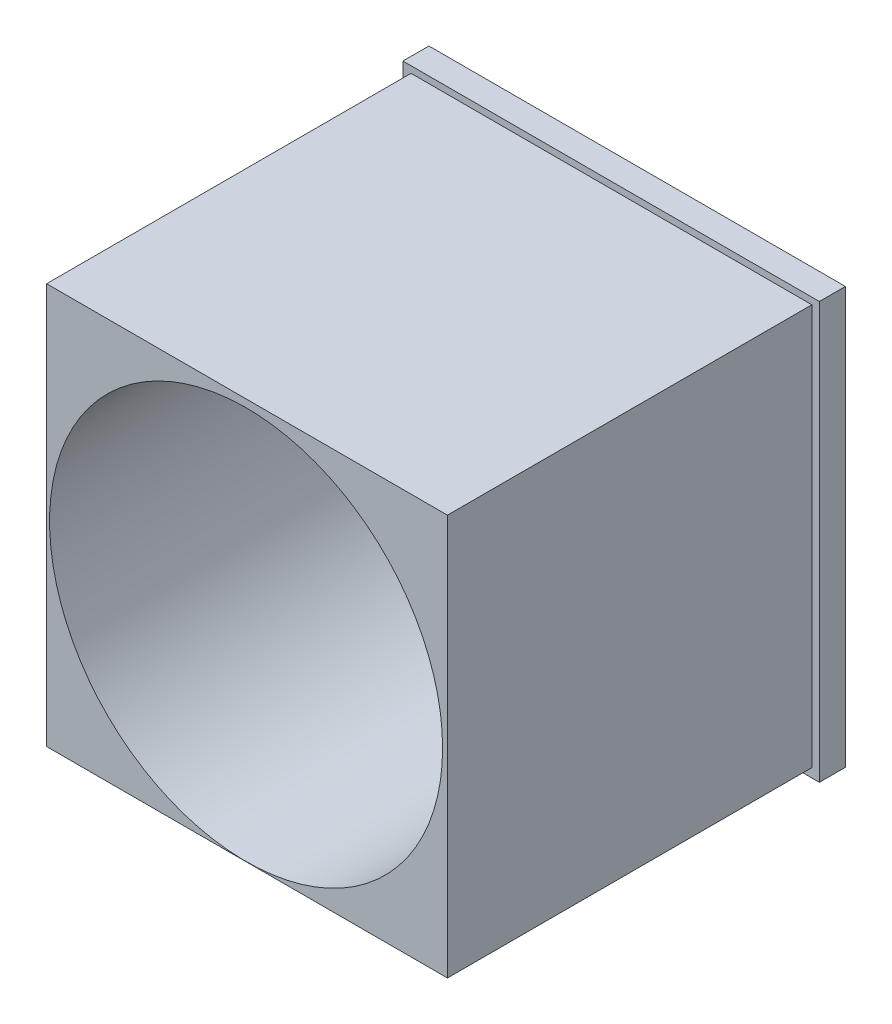
ISO-10303-21;
HEADER;
FILE_DESCRIPTION(('STEP AP214'),'2;1');
FILE_NAME('part.step','',(''),(''),'','','');
FILE_SCHEMA(('AUTOMOTIVE_DESIGN { 1 0 10303 214 1 1 1 1 }'));
ENDSEC;
DATA;
#1=APPLICATION_CONTEXT('core data for automotive mechanical design processes');
#2=APPLICATION_PROTOCOL_DEFINITION('international standard','automotive_design',2000,#1);
#3=PRODUCT_CONTEXT('',#1,'mechanical');
#4=PRODUCT('Part','Part','',(#3));
#5=PRODUCT_RELATED_PRODUCT_CATEGORY('part','',(#4));
#6=PRODUCT_DEFINITION_FORMATION('','',#4);
#7=PRODUCT_DEFINITION_CONTEXT('part definition',#1,'design');
#8=PRODUCT_DEFINITION('design','',#6,#7);
#9=PRODUCT_DEFINITION_SHAPE('','',#8);
#10=(LENGTH_UNIT() NAMED_UNIT(*) SI_UNIT(.MILLI.,.METRE.));
#11=(NAMED_UNIT(*) PLANE_ANGLE_UNIT() SI_UNIT($,.RADIAN.));
#12=(NAMED_UNIT(*) SI_UNIT($,.STERADIAN.) SOLID_ANGLE_UNIT());
#13=UNCERTAINTY_MEASURE_WITH_UNIT(LENGTH_MEASURE(1.E-05),#10,'distance_accuracy_value','');
#14=(GEOMETRIC_REPRESENTATION_CONTEXT(3) GLOBAL_UNCERTAINTY_ASSIGNED_CONTEXT((#13)) GLOBAL_UNIT_ASSIGNED_CONTEXT((#10,
#11,#12)) REPRESENTATION_CONTEXT('',''));
#15=CARTESIAN_POINT('',(0.,0.,0.));
#16=DIRECTION('',(0.,0.,1.));
#17=DIRECTION('',(1.,0.,0.));
#18=AXIS2_PLACEMENT_3D('',#15,#16,#17);
#19=CARTESIAN_POINT('',(-19.8830107526882,-18.3535483870968,38.1));
#20=DIRECTION('',(0.,1.,0.));
#21=DIRECTION('',(0.,0.,1.));
#22=AXIS2_PLACEMENT_3D('',#19,#20,#21);
#23=PLANE('',#22);
#24=DIRECTION('',(1.,0.,0.));
#25=VECTOR('',#24,1.);
#26=CARTESIAN_POINT('',(0.,-18.3535483870968,2.54000000000001));
#27=LINE('',#26,#25);
#28=CARTESIAN_POINT('',(-19.8830107526882,-18.3535483870968,2.54000000000001));
#29=VERTEX_POINT('',#28);
#30=CARTESIAN_POINT('',(20.7569892473118,-18.3535483870968,2.54000000000001));
#31=VERTEX_POINT('',#30);
#32=EDGE_CURVE('E104',#29,#31,#27,.T.);
#33=ORIENTED_EDGE('',*,*,#32,.F.);
#34=DIRECTION('',(0.,0.,-1.));
#35=VECTOR('',#34,1.);
#36=CARTESIAN_POINT('',(-19.8830107526882,-18.3535483870968,38.1));
#37=LINE('',#36,#35);
#38=CARTESIAN_POINT('',(-19.8830107526882,-18.3535483870968,0.));
#39=VERTEX_POINT('',#38);
#40=EDGE_CURVE('E115',#29,#39,#37,.T.);
#41=ORIENTED_EDGE('',*,*,#40,.T.);
#42=DIRECTION('',(1.,0.,0.));
#43=VECTOR('',#42,1.);
#44=CARTESIAN_POINT('',(-19.8830107526882,-18.3535483870968,0.));
#45=LINE('',#44,#43);
#46=CARTESIAN_POINT('',(20.7569892473118,-18.3535483870968,0.));
#47=VERTEX_POINT('',#46);
#48=EDGE_CURVE('E146',#39,#47,#45,.T.);
#49=ORIENTED_EDGE('',*,*,#48,.T.);
#50=DIRECTION('',(0.,0.,-1.));
#51=VECTOR('',#50,1.);
#52=CARTESIAN_POINT('',(20.7569892473118,-18.3535483870968,38.1));
#53=LINE('',#52,#51);
#54=EDGE_CURVE('E11',#31,#47,#53,.T.);
#55=ORIENTED_EDGE('',*,*,#54,.F.);
#56=EDGE_LOOP('',(#33,#41,#49,#55));
#57=FACE_BOUND('',#56,.T.);
#58=ADVANCED_FACE('F39',(#57),#23,.F.);
#59=CARTESIAN_POINT('',(20.7569892473118,22.2864516129032,38.1));
#60=DIRECTION('',(1.,0.,0.));
#61=DIRECTION('',(0.,1.,0.));
#62=AXIS2_PLACEMENT_3D('',#59,#60,#61);
#63=PLANE('',#62);
#64=DIRECTION('',(0.,0.,-1.));
#65=VECTOR('',#64,1.);
#66=CARTESIAN_POINT('',(20.7569892473118,22.2864516129032,38.1));
#67=LINE('',#66,#65);
#68=CARTESIAN_POINT('',(20.7569892473118,22.2864516129032,2.54000000000001));
#69=VERTEX_POINT('',#68);
#70=CARTESIAN_POINT('',(20.7569892473118,22.2864516129032,0.));
#71=VERTEX_POINT('',#70);
#72=EDGE_CURVE('E47',#69,#71,#67,.T.);
#73=ORIENTED_EDGE('',*,*,#72,.F.);
#74=DIRECTION('',(0.,1.,0.));
#75=VECTOR('',#74,1.);
#76=CARTESIAN_POINT('',(20.7569892473118,0.,2.54000000000001));
#77=LINE('',#76,#75);
#78=EDGE_CURVE('E118',#31,#69,#77,.T.);
#79=ORIENTED_EDGE('',*,*,#78,.F.);
#80=ORIENTED_EDGE('',*,*,#54,.T.);
#81=DIRECTION('',(0.,-1.,0.));
#82=VECTOR('',#81,1.);
#83=CARTESIAN_POINT('',(20.7569892473118,22.2864516129032,0.));
#84=LINE('',#83,#82);
#85=EDGE_CURVE('E142',#71,#47,#84,.T.);
#86=ORIENTED_EDGE('',*,*,#85,.F.);
#87=EDGE_LOOP('',(#73,#79,#80,#86));
#88=FACE_BOUND('',#87,.T.);
#89=ADVANCED_FACE('F143',(#88),#63,.T.);
#90=CARTESIAN_POINT('',(-19.8830107526882,22.2864516129032,38.1));
#91=DIRECTION('',(0.,1.,0.));
#92=DIRECTION('',(0.,0.,1.));
#93=AXIS2_PLACEMENT_3D('',#90,#91,#92);
#94=PLANE('',#93);
#95=DIRECTION('',(0.,0.,-1.));
#96=VECTOR('',#95,1.);
#97=CARTESIAN_POINT('',(-19.8830107526882,22.2864516129032,38.1));
#98=LINE('',#97,#96);
#99=CARTESIAN_POINT('',(-19.8830107526882,22.2864516129032,2.54000000000002));
#100=VERTEX_POINT('',#99);
#101=CARTESIAN_POINT('',(-19.8830107526882,22.2864516129032,0.));
#102=VERTEX_POINT('',#101);
#103=EDGE_CURVE('E125',#100,#102,#98,.T.);
#104=ORIENTED_EDGE('',*,*,#103,.F.);
#105=DIRECTION('',(-1.,0.,0.));
#106=VECTOR('',#105,1.);
#107=CARTESIAN_POINT('',(0.,22.2864516129032,2.54000000000001));
#108=LINE('',#107,#106);
#109=EDGE_CURVE('E54',#69,#100,#108,.T.);
#110=ORIENTED_EDGE('',*,*,#109,.F.);
#111=ORIENTED_EDGE('',*,*,#72,.T.);
#112=DIRECTION('',(1.,0.,0.));
#113=VECTOR('',#112,1.);
#114=CARTESIAN_POINT('',(-19.8830107526882,22.2864516129032,0.));
#115=LINE('',#114,#113);
#116=EDGE_CURVE('E130',#102,#71,#115,.T.);
#117=ORIENTED_EDGE('',*,*,#116,.F.);
#118=EDGE_LOOP('',(#104,#110,#111,#117));
#119=FACE_BOUND('',#118,.T.);
#120=ADVANCED_FACE('F138',(#119),#94,.T.);
#121=CARTESIAN_POINT('',(-19.8830107526882,22.2864516129032,38.1));
#122=DIRECTION('',(1.,0.,0.));
#123=DIRECTION('',(0.,1.,0.));
#124=AXIS2_PLACEMENT_3D('',#121,#122,#123);
#125=PLANE('',#124);
#126=DIRECTION('',(0.,-1.,0.));
#127=VECTOR('',#126,1.);
#128=CARTESIAN_POINT('',(-19.8830107526882,0.,2.54000000000001));
#129=LINE('',#128,#127);
#130=EDGE_CURVE('E100',#100,#29,#129,.T.);
#131=ORIENTED_EDGE('',*,*,#130,.F.);
#132=ORIENTED_EDGE('',*,*,#103,.T.);
#133=DIRECTION('',(0.,-1.,0.));
#134=VECTOR('',#133,1.);
#135=CARTESIAN_POINT('',(-19.8830107526882,22.2864516129032,0.));
#136=LINE('',#135,#134);
#137=EDGE_CURVE('E122',#102,#39,#136,.T.);
#138=ORIENTED_EDGE('',*,*,#137,.T.);
#139=ORIENTED_EDGE('',*,*,#40,.F.);
#140=EDGE_LOOP('',(#131,#132,#138,#139));
#141=FACE_BOUND('',#140,.T.);
#142=ADVANCED_FACE('F120',(#141),#125,.F.);
#143=CARTESIAN_POINT('',(0.,0.,0.));
#144=DIRECTION('',(0.,0.,-1.));
#145=DIRECTION('',(-1.,0.,0.));
#146=AXIS2_PLACEMENT_3D('',#143,#144,#145);
#147=PLANE('',#146);
#148=ORIENTED_EDGE('',*,*,#48,.F.);
#149=ORIENTED_EDGE('',*,*,#137,.F.);
#150=ORIENTED_EDGE('',*,*,#116,.T.);
#151=ORIENTED_EDGE('',*,*,#85,.T.);
#152=EDGE_LOOP('',(#148,#149,#150,#151));
#153=FACE_BOUND('',#152,.T.);
#154=ADVANCED_FACE('F148',(#153),#147,.T.);
#155=CARTESIAN_POINT('',(0.,21.6424241415853,2.54000000000001));
#156=DIRECTION('',(0.,-1.,0.));
#157=DIRECTION('',(0.,0.,-1.));
#158=AXIS2_PLACEMENT_3D('',#155,#156,#157);
#159=PLANE('',#158);
#160=DIRECTION('',(1.,0.,0.));
#161=VECTOR('',#160,1.);
#162=CARTESIAN_POINT('',(0.,21.6424241415853,38.1));
#163=LINE('',#162,#161);
#164=CARTESIAN_POINT('',(-19.0911393380556,21.6424241415853,38.1));
#165=VERTEX_POINT('',#164);
#166=CARTESIAN_POINT('',(20.0248606619444,21.6424241415853,38.1));
#167=VERTEX_POINT('',#166);
#168=EDGE_CURVE('E62',#165,#167,#163,.T.);
#169=ORIENTED_EDGE('',*,*,#168,.T.);
#170=DIRECTION('',(0.,0.,1.));
#171=VECTOR('',#170,1.);
#172=CARTESIAN_POINT('',(20.0248606619444,21.6424241415853,2.54000000000001));
#173=LINE('',#172,#171);
#174=CARTESIAN_POINT('',(20.0248606619444,21.6424241415853,2.54000000000001));
#175=VERTEX_POINT('',#174);
#176=EDGE_CURVE('E154',#175,#167,#173,.T.);
#177=ORIENTED_EDGE('',*,*,#176,.F.);
#178=DIRECTION('',(1.,0.,0.));
#179=VECTOR('',#178,1.);
#180=CARTESIAN_POINT('',(0.,21.6424241415853,2.54000000000001));
#181=LINE('',#180,#179);
#182=CARTESIAN_POINT('',(-19.0911393380556,21.6424241415853,2.54000000000001));
#183=VERTEX_POINT('',#182);
#184=EDGE_CURVE('E191',#183,#175,#181,.T.);
#185=ORIENTED_EDGE('',*,*,#184,.F.);
#186=DIRECTION('',(0.,0.,1.));
#187=VECTOR('',#186,1.);
#188=CARTESIAN_POINT('',(-19.0911393380556,21.6424241415853,2.54000000000001));
#189=LINE('',#188,#187);
#190=EDGE_CURVE('E153',#183,#165,#189,.T.);
#191=ORIENTED_EDGE('',*,*,#190,.T.);
#192=EDGE_LOOP('',(#169,#177,#185,#191));
#193=FACE_BOUND('',#192,.T.);
#194=ADVANCED_FACE('F225',(#193),#159,.F.);
#195=CARTESIAN_POINT('',(-19.0911393380556,0.,2.54000000000001));
#196=DIRECTION('',(-1.,0.,0.));
#197=DIRECTION('',(0.,-1.,0.));
#198=AXIS2_PLACEMENT_3D('',#195,#196,#197);
#199=PLANE('',#198);
#200=DIRECTION('',(0.,-1.,0.));
#201=VECTOR('',#200,1.);
#202=CARTESIAN_POINT('',(-19.0911393380556,0.,38.1));
#203=LINE('',#202,#201);
#204=CARTESIAN_POINT('',(-19.0911393380556,-17.4735758584147,38.1));
#205=VERTEX_POINT('',#204);
#206=EDGE_CURVE('E110',#165,#205,#203,.T.);
#207=ORIENTED_EDGE('',*,*,#206,.F.);
#208=ORIENTED_EDGE('',*,*,#190,.F.);
#209=DIRECTION('',(0.,-1.,0.));
#210=VECTOR('',#209,1.);
#211=CARTESIAN_POINT('',(-19.0911393380556,0.,2.54000000000001));
#212=LINE('',#211,#210);
#213=CARTESIAN_POINT('',(-19.0911393380556,-17.4735758584147,2.54000000000001));
#214=VERTEX_POINT('',#213);
#215=EDGE_CURVE('E158',#183,#214,#212,.T.);
#216=ORIENTED_EDGE('',*,*,#215,.T.);
#217=DIRECTION('',(0.,0.,1.));
#218=VECTOR('',#217,1.);
#219=CARTESIAN_POINT('',(-19.0911393380556,-17.4735758584147,2.54000000000001));
#220=LINE('',#219,#218);
#221=EDGE_CURVE('E161',#214,#205,#220,.T.);
#222=ORIENTED_EDGE('',*,*,#221,.T.);
#223=EDGE_LOOP('',(#207,#208,#216,#222));
#224=FACE_BOUND('',#223,.T.);
#225=ADVANCED_FACE('F230',(#224),#199,.T.);
#226=CARTESIAN_POINT('',(0.,-17.4735758584147,2.54000000000001));
#227=DIRECTION('',(0.,-1.,0.));
#228=DIRECTION('',(0.,0.,-1.));
#229=AXIS2_PLACEMENT_3D('',#226,#227,#228);
#230=PLANE('',#229);
#231=DIRECTION('',(1.,0.,0.));
#232=VECTOR('',#231,1.);
#233=CARTESIAN_POINT('',(0.,-17.4735758584147,38.1));
#234=LINE('',#233,#232);
#235=CARTESIAN_POINT('',(20.0248606619444,-17.4735758584147,38.1));
#236=VERTEX_POINT('',#235);
#237=EDGE_CURVE('E170',#205,#236,#234,.T.);
#238=ORIENTED_EDGE('',*,*,#237,.F.);
#239=ORIENTED_EDGE('',*,*,#221,.F.);
#240=DIRECTION('',(1.,0.,0.));
#241=VECTOR('',#240,1.);
#242=CARTESIAN_POINT('',(0.,-17.4735758584147,2.54000000000001));
#243=LINE('',#242,#241);
#244=CARTESIAN_POINT('',(20.0248606619444,-17.4735758584147,2.54000000000001));
#245=VERTEX_POINT('',#244);
#246=EDGE_CURVE('E184',#214,#245,#243,.T.);
#247=ORIENTED_EDGE('',*,*,#246,.T.);
#248=DIRECTION('',(0.,0.,1.));
#249=VECTOR('',#248,1.);
#250=CARTESIAN_POINT('',(20.0248606619444,-17.4735758584147,2.54000000000001));
#251=LINE('',#250,#249);
#252=EDGE_CURVE('E157',#245,#236,#251,.T.);
#253=ORIENTED_EDGE('',*,*,#252,.T.);
#254=EDGE_LOOP('',(#238,#239,#247,#253));
#255=FACE_BOUND('',#254,.T.);
#256=ADVANCED_FACE('F232',(#255),#230,.T.);
#257=CARTESIAN_POINT('',(20.0248606619444,0.,2.54000000000001));
#258=DIRECTION('',(-1.,0.,0.));
#259=DIRECTION('',(0.,-1.,0.));
#260=AXIS2_PLACEMENT_3D('',#257,#258,#259);
#261=PLANE('',#260);
#262=DIRECTION('',(0.,-1.,0.));
#263=VECTOR('',#262,1.);
#264=CARTESIAN_POINT('',(20.0248606619444,0.,38.1));
#265=LINE('',#264,#263);
#266=EDGE_CURVE('E174',#167,#236,#265,.T.);
#267=ORIENTED_EDGE('',*,*,#266,.T.);
#268=ORIENTED_EDGE('',*,*,#252,.F.);
#269=DIRECTION('',(0.,-1.,0.));
#270=VECTOR('',#269,1.);
#271=CARTESIAN_POINT('',(20.0248606619444,0.,2.54000000000001));
#272=LINE('',#271,#270);
#273=EDGE_CURVE('E187',#175,#245,#272,.T.);
#274=ORIENTED_EDGE('',*,*,#273,.F.);
#275=ORIENTED_EDGE('',*,*,#176,.T.);
#276=EDGE_LOOP('',(#267,#268,#274,#275));
#277=FACE_BOUND('',#276,.T.);
#278=ADVANCED_FACE('F222',(#277),#261,.F.);
#279=CARTESIAN_POINT('',(0.,0.,2.54000000000001));
#280=DIRECTION('',(0.,0.,1.));
#281=DIRECTION('',(1.,0.,0.));
#282=AXIS2_PLACEMENT_3D('',#279,#280,#281);
#283=PLANE('',#282);
#284=ORIENTED_EDGE('',*,*,#130,.T.);
#285=ORIENTED_EDGE('',*,*,#32,.T.);
#286=ORIENTED_EDGE('',*,*,#78,.T.);
#287=ORIENTED_EDGE('',*,*,#109,.T.);
#288=EDGE_LOOP('',(#284,#285,#286,#287));
#289=FACE_BOUND('',#288,.T.);
#290=ORIENTED_EDGE('',*,*,#184,.T.);
#291=ORIENTED_EDGE('',*,*,#273,.T.);
#292=ORIENTED_EDGE('',*,*,#246,.F.);
#293=ORIENTED_EDGE('',*,*,#215,.F.);
#294=EDGE_LOOP('',(#290,#291,#292,#293));
#295=FACE_BOUND('',#294,.T.);
#296=ADVANCED_FACE('F102',(#289,#295),#283,.T.);
#297=CARTESIAN_POINT('',(0.,0.,38.1));
#298=DIRECTION('',(0.,0.,-1.));
#299=DIRECTION('',(-1.,0.,0.));
#300=AXIS2_PLACEMENT_3D('',#297,#298,#299);
#301=PLANE('',#300);
#302=CARTESIAN_POINT('',(0.375302990395433,1.71970658523773,38.1));
#303=DIRECTION('',(0.,0.,1.));
#304=DIRECTION('',(1.,0.,0.));
#305=AXIS2_PLACEMENT_3D('',#302,#303,#304);
#306=CIRCLE('',#305,19.177);
#307=CARTESIAN_POINT('',(19.5523029903954,1.71970658523773,38.1));
#308=VERTEX_POINT('',#307);
#309=EDGE_CURVE('E199',#308,#308,#306,.T.);
#310=ORIENTED_EDGE('',*,*,#309,.F.);
#311=EDGE_LOOP('',(#310));
#312=FACE_BOUND('',#311,.T.);
#313=ORIENTED_EDGE('',*,*,#266,.F.);
#314=ORIENTED_EDGE('',*,*,#168,.F.);
#315=ORIENTED_EDGE('',*,*,#206,.T.);
#316=ORIENTED_EDGE('',*,*,#237,.T.);
#317=EDGE_LOOP('',(#313,#314,#315,#316));
#318=FACE_BOUND('',#317,.T.);
#319=ADVANCED_FACE('F212',(#312,#318),#301,.F.);
#320=CARTESIAN_POINT('',(0.375302990395433,1.71970658523773,2.54000000000001));
#321=DIRECTION('',(0.,0.,1.));
#322=DIRECTION('',(1.,0.,0.));
#323=AXIS2_PLACEMENT_3D('',#320,#321,#322);
#324=CYLINDRICAL_SURFACE('',#323,19.177);
#325=CARTESIAN_POINT('',(0.375302990395433,1.71970658523773,2.54000000000001));
#326=DIRECTION('',(0.,0.,1.));
#327=DIRECTION('',(1.,0.,0.));
#328=AXIS2_PLACEMENT_3D('',#325,#326,#327);
#329=CIRCLE('',#328,19.177);
#330=CARTESIAN_POINT('',(19.5523029903954,1.71970658523773,2.54000000000001));
#331=VERTEX_POINT('',#330);
#332=EDGE_CURVE('E180',#331,#331,#329,.T.);
#333=ORIENTED_EDGE('',*,*,#332,.F.);
#334=EDGE_LOOP('',(#333));
#335=FACE_BOUND('',#334,.T.);
#336=ORIENTED_EDGE('',*,*,#309,.T.);
#337=EDGE_LOOP('',(#336));
#338=FACE_BOUND('',#337,.T.);
#339=ADVANCED_FACE('F209',(#335,#338),#324,.F.);
#340=CARTESIAN_POINT('',(0.375302990395433,1.71970658523773,2.54000000000001));
#341=DIRECTION('',(0.,0.,1.));
#342=DIRECTION('',(1.,0.,0.));
#343=AXIS2_PLACEMENT_3D('',#340,#341,#342);
#344=PLANE('',#343);
#345=ORIENTED_EDGE('',*,*,#332,.T.);
#346=EDGE_LOOP('',(#345));
#347=FACE_BOUND('',#346,.T.);
#348=ADVANCED_FACE('F207',(#347),#344,.T.);
#349=CLOSED_SHELL('',(#58,#89,#120,#142,#154,#194,#225,#256,#278,#296,#319,#339,#348));
#350=MANIFOLD_SOLID_BREP('B2',#349);
#351=ADVANCED_BREP_SHAPE_REPRESENTATION('',(#18,#350),#14);
#352=SHAPE_DEFINITION_REPRESENTATION(#9,#351);
ENDSEC;
END-ISO-10303-21;
